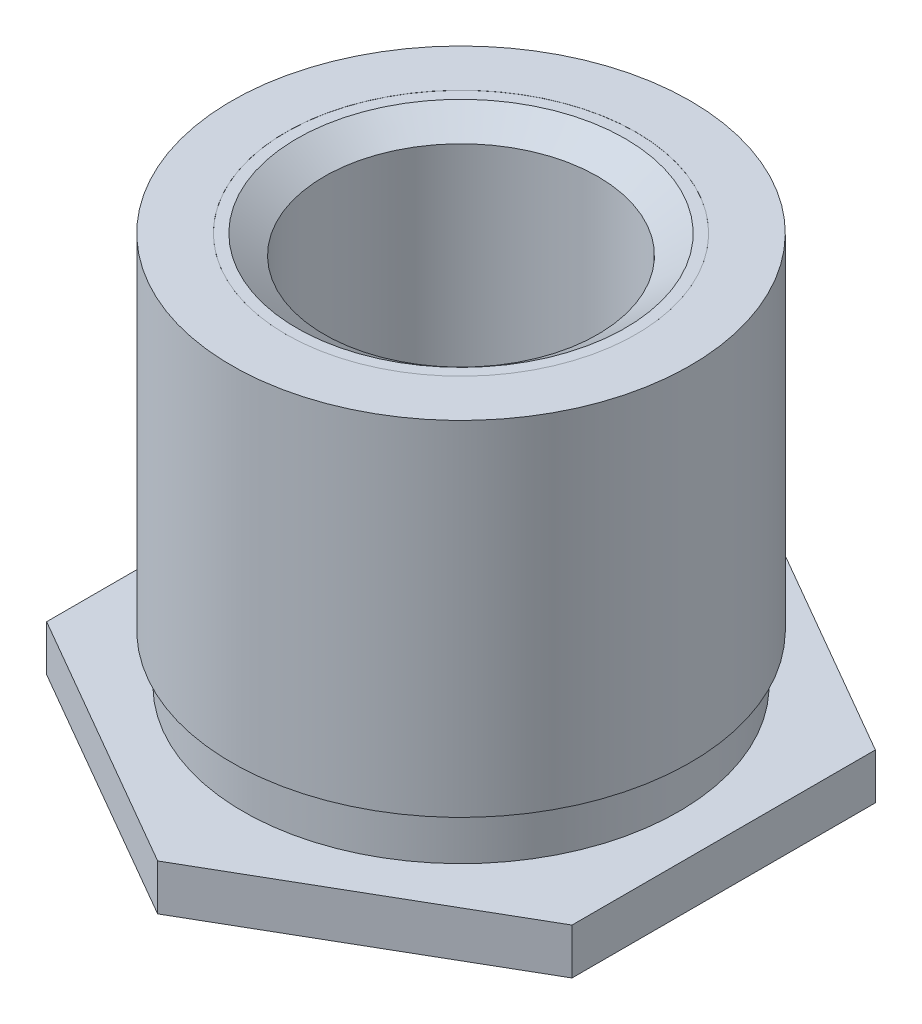
ISO-10303-21;
HEADER;
FILE_DESCRIPTION(('STEP AP214'),'2;1');
FILE_NAME('part.step','',(''),(''),'','','');
FILE_SCHEMA(('AUTOMOTIVE_DESIGN { 1 0 10303 214 1 1 1 1 }'));
ENDSEC;
DATA;
#1=APPLICATION_CONTEXT('core data for automotive mechanical design processes');
#2=APPLICATION_PROTOCOL_DEFINITION('international standard','automotive_design',2000,#1);
#3=PRODUCT_CONTEXT('',#1,'mechanical');
#4=PRODUCT('Part','Part','',(#3));
#5=PRODUCT_RELATED_PRODUCT_CATEGORY('part','',(#4));
#6=PRODUCT_DEFINITION_FORMATION('','',#4);
#7=PRODUCT_DEFINITION_CONTEXT('part definition',#1,'design');
#8=PRODUCT_DEFINITION('design','',#6,#7);
#9=PRODUCT_DEFINITION_SHAPE('','',#8);
#10=(LENGTH_UNIT() NAMED_UNIT(*) SI_UNIT(.MILLI.,.METRE.));
#11=(NAMED_UNIT(*) PLANE_ANGLE_UNIT() SI_UNIT($,.RADIAN.));
#12=(NAMED_UNIT(*) SI_UNIT($,.STERADIAN.) SOLID_ANGLE_UNIT());
#13=UNCERTAINTY_MEASURE_WITH_UNIT(LENGTH_MEASURE(1.E-05),#10,'distance_accuracy_value','');
#14=(GEOMETRIC_REPRESENTATION_CONTEXT(3) GLOBAL_UNCERTAINTY_ASSIGNED_CONTEXT((#13)) GLOBAL_UNIT_ASSIGNED_CONTEXT((#10,
#11,#12)) REPRESENTATION_CONTEXT('',''));
#15=CARTESIAN_POINT('',(0.,0.,0.));
#16=DIRECTION('',(0.,0.,1.));
#17=DIRECTION('',(1.,0.,0.));
#18=AXIS2_PLACEMENT_3D('',#15,#16,#17);
#19=CARTESIAN_POINT('',(2.784,0.419,0.));
#20=DIRECTION('',(0.,1.,0.));
#21=DIRECTION('',(0.,0.,1.));
#22=AXIS2_PLACEMENT_3D('',#19,#20,#21);
#23=PLANE('',#22);
#24=CARTESIAN_POINT('',(0.,0.419,0.));
#25=DIRECTION('',(0.,-1.,0.));
#26=DIRECTION('',(0.,0.,-1.));
#27=AXIS2_PLACEMENT_3D('',#24,#25,#26);
#28=CIRCLE('',#27,1.99025);
#29=CARTESIAN_POINT('',(0.,0.419,-1.99025));
#30=VERTEX_POINT('',#29);
#31=EDGE_CURVE('E11',#30,#30,#28,.T.);
#32=ORIENTED_EDGE('',*,*,#31,.T.);
#33=EDGE_LOOP('',(#32));
#34=FACE_BOUND('',#33,.T.);
#35=DIRECTION('',(0.866025403784439,0.,0.5));
#36=VECTOR('',#35,1.);
#37=CARTESIAN_POINT('',(0.,0.419,2.7712812921102));
#38=LINE('',#37,#36);
#39=CARTESIAN_POINT('',(-2.4,0.419,1.3856406460551));
#40=VERTEX_POINT('',#39);
#41=CARTESIAN_POINT('',(0.,0.419,2.7712812921102));
#42=VERTEX_POINT('',#41);
#43=EDGE_CURVE('E130',#40,#42,#38,.T.);
#44=ORIENTED_EDGE('',*,*,#43,.T.);
#45=DIRECTION('',(0.866025403784439,0.,-0.5));
#46=VECTOR('',#45,1.);
#47=CARTESIAN_POINT('',(2.4,0.419,1.3856406460551));
#48=LINE('',#47,#46);
#49=CARTESIAN_POINT('',(2.4,0.419,1.3856406460551));
#50=VERTEX_POINT('',#49);
#51=EDGE_CURVE('E119',#42,#50,#48,.T.);
#52=ORIENTED_EDGE('',*,*,#51,.T.);
#53=DIRECTION('',(0.,0.,-1.));
#54=VECTOR('',#53,1.);
#55=CARTESIAN_POINT('',(2.4,0.419,-1.3856406460551));
#56=LINE('',#55,#54);
#57=CARTESIAN_POINT('',(2.4,0.419,-1.3856406460551));
#58=VERTEX_POINT('',#57);
#59=EDGE_CURVE('E122',#50,#58,#56,.T.);
#60=ORIENTED_EDGE('',*,*,#59,.T.);
#61=DIRECTION('',(-0.866025403784439,0.,-0.5));
#62=VECTOR('',#61,1.);
#63=CARTESIAN_POINT('',(0.,0.419,-2.7712812921102));
#64=LINE('',#63,#62);
#65=CARTESIAN_POINT('',(0.,0.419,-2.7712812921102));
#66=VERTEX_POINT('',#65);
#67=EDGE_CURVE('E50',#58,#66,#64,.T.);
#68=ORIENTED_EDGE('',*,*,#67,.T.);
#69=DIRECTION('',(-0.866025403784439,0.,0.5));
#70=VECTOR('',#69,1.);
#71=CARTESIAN_POINT('',(-2.4,0.419,-1.3856406460551));
#72=LINE('',#71,#70);
#73=CARTESIAN_POINT('',(-2.4,0.419,-1.3856406460551));
#74=VERTEX_POINT('',#73);
#75=EDGE_CURVE('E95',#66,#74,#72,.T.);
#76=ORIENTED_EDGE('',*,*,#75,.T.);
#77=DIRECTION('',(0.,0.,1.));
#78=VECTOR('',#77,1.);
#79=CARTESIAN_POINT('',(-2.4,0.419,1.3856406460551));
#80=LINE('',#79,#78);
#81=EDGE_CURVE('E127',#74,#40,#80,.T.);
#82=ORIENTED_EDGE('',*,*,#81,.T.);
#83=EDGE_LOOP('',(#44,#52,#60,#68,#76,#82));
#84=FACE_BOUND('',#83,.T.);
#85=ADVANCED_FACE('F34',(#34,#84),#23,.T.);
#86=CARTESIAN_POINT('',(2.095,0.,0.));
#87=DIRECTION('',(0.,-1.,0.));
#88=DIRECTION('',(0.,0.,-1.));
#89=AXIS2_PLACEMENT_3D('',#86,#87,#88);
#90=PLANE('',#89);
#91=CARTESIAN_POINT('',(0.,0.,0.));
#92=DIRECTION('',(0.,-1.,0.));
#93=DIRECTION('',(0.,0.,-1.));
#94=AXIS2_PLACEMENT_3D('',#91,#92,#93);
#95=CIRCLE('',#94,2.095);
#96=CARTESIAN_POINT('',(0.,0.,-2.095));
#97=VERTEX_POINT('',#96);
#98=EDGE_CURVE('E149',#97,#97,#95,.T.);
#99=ORIENTED_EDGE('',*,*,#98,.F.);
#100=EDGE_LOOP('',(#99));
#101=FACE_BOUND('',#100,.T.);
#102=DIRECTION('',(0.,0.,-1.));
#103=VECTOR('',#102,1.);
#104=CARTESIAN_POINT('',(2.4,0.,-1.3856406460551));
#105=LINE('',#104,#103);
#106=CARTESIAN_POINT('',(2.4,0.,1.3856406460551));
#107=VERTEX_POINT('',#106);
#108=CARTESIAN_POINT('',(2.4,0.,-1.3856406460551));
#109=VERTEX_POINT('',#108);
#110=EDGE_CURVE('E105',#107,#109,#105,.T.);
#111=ORIENTED_EDGE('',*,*,#110,.F.);
#112=DIRECTION('',(0.866025403784439,0.,-0.5));
#113=VECTOR('',#112,1.);
#114=CARTESIAN_POINT('',(2.4,0.,1.3856406460551));
#115=LINE('',#114,#113);
#116=CARTESIAN_POINT('',(0.,0.,2.7712812921102));
#117=VERTEX_POINT('',#116);
#118=EDGE_CURVE('E58',#117,#107,#115,.T.);
#119=ORIENTED_EDGE('',*,*,#118,.F.);
#120=DIRECTION('',(0.866025403784439,0.,0.5));
#121=VECTOR('',#120,1.);
#122=CARTESIAN_POINT('',(0.,0.,2.7712812921102));
#123=LINE('',#122,#121);
#124=CARTESIAN_POINT('',(-2.4,0.,1.3856406460551));
#125=VERTEX_POINT('',#124);
#126=EDGE_CURVE('E112',#125,#117,#123,.T.);
#127=ORIENTED_EDGE('',*,*,#126,.F.);
#128=DIRECTION('',(0.,0.,1.));
#129=VECTOR('',#128,1.);
#130=CARTESIAN_POINT('',(-2.4,0.,1.3856406460551));
#131=LINE('',#130,#129);
#132=CARTESIAN_POINT('',(-2.4,0.,-1.3856406460551));
#133=VERTEX_POINT('',#132);
#134=EDGE_CURVE('E110',#133,#125,#131,.T.);
#135=ORIENTED_EDGE('',*,*,#134,.F.);
#136=DIRECTION('',(-0.866025403784439,0.,0.5));
#137=VECTOR('',#136,1.);
#138=CARTESIAN_POINT('',(-2.4,0.,-1.3856406460551));
#139=LINE('',#138,#137);
#140=CARTESIAN_POINT('',(0.,0.,-2.7712812921102));
#141=VERTEX_POINT('',#140);
#142=EDGE_CURVE('E92',#141,#133,#139,.T.);
#143=ORIENTED_EDGE('',*,*,#142,.F.);
#144=DIRECTION('',(-0.866025403784439,0.,-0.5));
#145=VECTOR('',#144,1.);
#146=CARTESIAN_POINT('',(0.,0.,-2.7712812921102));
#147=LINE('',#146,#145);
#148=EDGE_CURVE('E100',#109,#141,#147,.T.);
#149=ORIENTED_EDGE('',*,*,#148,.F.);
#150=EDGE_LOOP('',(#111,#119,#127,#135,#143,#149));
#151=FACE_BOUND('',#150,.T.);
#152=ADVANCED_FACE('F107',(#101,#151),#90,.T.);
#153=CARTESIAN_POINT('',(0.,0.,0.));
#154=DIRECTION('',(0.,-1.,0.));
#155=DIRECTION('',(0.,0.,-1.));
#156=AXIS2_PLACEMENT_3D('',#153,#154,#155);
#157=CYLINDRICAL_SURFACE('',#156,1.99025);
#158=CARTESIAN_POINT('',(0.,0.85895,0.));
#159=DIRECTION('',(0.,-1.,0.));
#160=DIRECTION('',(0.,0.,-1.));
#161=AXIS2_PLACEMENT_3D('',#158,#159,#160);
#162=CIRCLE('',#161,1.99025);
#163=CARTESIAN_POINT('',(0.,0.85895,-1.99025));
#164=VERTEX_POINT('',#163);
#165=EDGE_CURVE('E42',#164,#164,#162,.T.);
#166=ORIENTED_EDGE('',*,*,#165,.T.);
#167=EDGE_LOOP('',(#166));
#168=FACE_BOUND('',#167,.T.);
#169=ORIENTED_EDGE('',*,*,#31,.F.);
#170=EDGE_LOOP('',(#169));
#171=FACE_BOUND('',#170,.T.);
#172=ADVANCED_FACE('F188',(#168,#171),#157,.T.);
#173=CARTESIAN_POINT('',(2.095,0.85895,0.));
#174=DIRECTION('',(0.,-1.,0.));
#175=DIRECTION('',(0.,0.,-1.));
#176=AXIS2_PLACEMENT_3D('',#173,#174,#175);
#177=PLANE('',#176);
#178=CARTESIAN_POINT('',(0.,0.85895,0.));
#179=DIRECTION('',(0.,-1.,0.));
#180=DIRECTION('',(0.,0.,-1.));
#181=AXIS2_PLACEMENT_3D('',#178,#179,#180);
#182=CIRCLE('',#181,2.095);
#183=CARTESIAN_POINT('',(0.,0.85895,-2.095));
#184=VERTEX_POINT('',#183);
#185=EDGE_CURVE('E159',#184,#184,#182,.T.);
#186=ORIENTED_EDGE('',*,*,#185,.T.);
#187=EDGE_LOOP('',(#186));
#188=FACE_BOUND('',#187,.T.);
#189=ORIENTED_EDGE('',*,*,#165,.F.);
#190=EDGE_LOOP('',(#189));
#191=FACE_BOUND('',#190,.T.);
#192=ADVANCED_FACE('F182',(#188,#191),#177,.T.);
#193=CARTESIAN_POINT('',(0.,0.,0.));
#194=DIRECTION('',(0.,-1.,0.));
#195=DIRECTION('',(0.,0.,-1.));
#196=AXIS2_PLACEMENT_3D('',#193,#194,#195);
#197=CYLINDRICAL_SURFACE('',#196,2.095);
#198=CARTESIAN_POINT('',(0.,4.,0.));
#199=DIRECTION('',(0.,-1.,0.));
#200=DIRECTION('',(0.,0.,-1.));
#201=AXIS2_PLACEMENT_3D('',#198,#199,#200);
#202=CIRCLE('',#201,2.095);
#203=CARTESIAN_POINT('',(0.,4.,-2.095));
#204=VERTEX_POINT('',#203);
#205=EDGE_CURVE('E156',#204,#204,#202,.T.);
#206=ORIENTED_EDGE('',*,*,#205,.T.);
#207=EDGE_LOOP('',(#206));
#208=FACE_BOUND('',#207,.T.);
#209=ORIENTED_EDGE('',*,*,#185,.F.);
#210=EDGE_LOOP('',(#209));
#211=FACE_BOUND('',#210,.T.);
#212=ADVANCED_FACE('F176',(#208,#211),#197,.T.);
#213=CARTESIAN_POINT('',(2.095,4.,0.));
#214=DIRECTION('',(0.,1.,0.));
#215=DIRECTION('',(0.,0.,1.));
#216=AXIS2_PLACEMENT_3D('',#213,#214,#215);
#217=PLANE('',#216);
#218=CARTESIAN_POINT('',(0.,4.,0.));
#219=DIRECTION('',(0.,1.,0.));
#220=DIRECTION('',(0.,0.,1.));
#221=AXIS2_PLACEMENT_3D('',#218,#219,#220);
#222=CIRCLE('',#221,1.6);
#223=CARTESIAN_POINT('',(0.,4.,1.6));
#224=VERTEX_POINT('',#223);
#225=EDGE_CURVE('E37',#224,#224,#222,.T.);
#226=ORIENTED_EDGE('',*,*,#225,.F.);
#227=EDGE_LOOP('',(#226));
#228=FACE_BOUND('',#227,.T.);
#229=ORIENTED_EDGE('',*,*,#205,.F.);
#230=EDGE_LOOP('',(#229));
#231=FACE_BOUND('',#230,.T.);
#232=ADVANCED_FACE('F172',(#228,#231),#217,.T.);
#233=CARTESIAN_POINT('',(0.,0.,0.));
#234=DIRECTION('',(0.,-1.,0.));
#235=DIRECTION('',(0.,0.,-1.));
#236=AXIS2_PLACEMENT_3D('',#233,#234,#235);
#237=CYLINDRICAL_SURFACE('',#236,1.25);
#238=CARTESIAN_POINT('',(0.,3.8240131336967,0.));
#239=DIRECTION('',(0.,-1.,0.));
#240=DIRECTION('',(0.,0.,-1.));
#241=AXIS2_PLACEMENT_3D('',#238,#239,#240);
#242=CIRCLE('',#241,1.25);
#243=CARTESIAN_POINT('',(0.,3.8240131336967,-1.25));
#244=VERTEX_POINT('',#243);
#245=EDGE_CURVE('E143',#244,#244,#242,.T.);
#246=ORIENTED_EDGE('',*,*,#245,.F.);
#247=EDGE_LOOP('',(#246));
#248=FACE_BOUND('',#247,.T.);
#249=CARTESIAN_POINT('',(0.,0.00253999999999969,0.));
#250=DIRECTION('',(0.,-1.,0.));
#251=DIRECTION('',(0.,0.,-1.));
#252=AXIS2_PLACEMENT_3D('',#249,#250,#251);
#253=CIRCLE('',#252,1.25);
#254=CARTESIAN_POINT('',(0.,0.00253999999999969,-1.25));
#255=VERTEX_POINT('',#254);
#256=EDGE_CURVE('E153',#255,#255,#253,.T.);
#257=ORIENTED_EDGE('',*,*,#256,.T.);
#258=EDGE_LOOP('',(#257));
#259=FACE_BOUND('',#258,.T.);
#260=ADVANCED_FACE('F175',(#248,#259),#237,.F.);
#261=CARTESIAN_POINT('',(2.095,0.00253999999999969,0.));
#262=DIRECTION('',(0.,-1.,0.));
#263=DIRECTION('',(0.,0.,-1.));
#264=AXIS2_PLACEMENT_3D('',#261,#262,#263);
#265=PLANE('',#264);
#266=ORIENTED_EDGE('',*,*,#256,.F.);
#267=EDGE_LOOP('',(#266));
#268=FACE_BOUND('',#267,.T.);
#269=CARTESIAN_POINT('',(0.,0.00253999999999982,0.));
#270=DIRECTION('',(0.,-1.,0.));
#271=DIRECTION('',(0.,0.,-1.));
#272=AXIS2_PLACEMENT_3D('',#269,#270,#271);
#273=CIRCLE('',#272,2.095);
#274=CARTESIAN_POINT('',(0.,0.00253999999999982,-2.095));
#275=VERTEX_POINT('',#274);
#276=EDGE_CURVE('E152',#275,#275,#273,.T.);
#277=ORIENTED_EDGE('',*,*,#276,.T.);
#278=EDGE_LOOP('',(#277));
#279=FACE_BOUND('',#278,.T.);
#280=ADVANCED_FACE('F234',(#268,#279),#265,.T.);
#281=CARTESIAN_POINT('',(0.,0.,0.));
#282=DIRECTION('',(0.,-1.,0.));
#283=DIRECTION('',(0.,0.,-1.));
#284=AXIS2_PLACEMENT_3D('',#281,#282,#283);
#285=CYLINDRICAL_SURFACE('',#284,2.095);
#286=ORIENTED_EDGE('',*,*,#98,.T.);
#287=EDGE_LOOP('',(#286));
#288=FACE_BOUND('',#287,.T.);
#289=ORIENTED_EDGE('',*,*,#276,.F.);
#290=EDGE_LOOP('',(#289));
#291=FACE_BOUND('',#290,.T.);
#292=ADVANCED_FACE('F227',(#288,#291),#285,.F.);
#293=CARTESIAN_POINT('',(1.6,3.999,0.));
#294=DIRECTION('',(0.,-1.,0.));
#295=DIRECTION('',(0.,0.,-1.));
#296=AXIS2_PLACEMENT_3D('',#293,#294,#295);
#297=PLANE('',#296);
#298=CARTESIAN_POINT('',(0.,3.999,0.));
#299=DIRECTION('',(0.,-1.,0.));
#300=DIRECTION('',(0.,0.,-1.));
#301=AXIS2_PLACEMENT_3D('',#298,#299,#300);
#302=CIRCLE('',#301,1.6);
#303=CARTESIAN_POINT('',(0.,3.999,-1.6));
#304=VERTEX_POINT('',#303);
#305=EDGE_CURVE('E135',#304,#304,#302,.T.);
#306=ORIENTED_EDGE('',*,*,#305,.F.);
#307=EDGE_LOOP('',(#306));
#308=FACE_BOUND('',#307,.T.);
#309=CARTESIAN_POINT('',(0.,3.999,0.));
#310=DIRECTION('',(0.,-1.,0.));
#311=DIRECTION('',(0.,0.,-1.));
#312=AXIS2_PLACEMENT_3D('',#309,#310,#311);
#313=CIRCLE('',#312,1.5);
#314=CARTESIAN_POINT('',(0.,3.999,-1.5));
#315=VERTEX_POINT('',#314);
#316=EDGE_CURVE('E146',#315,#315,#313,.T.);
#317=ORIENTED_EDGE('',*,*,#316,.T.);
#318=EDGE_LOOP('',(#317));
#319=FACE_BOUND('',#318,.T.);
#320=ADVANCED_FACE('F223',(#308,#319),#297,.F.);
#321=CARTESIAN_POINT('',(0.,3.8240131336967,0.));
#322=DIRECTION('',(0.,1.,0.));
#323=DIRECTION('',(0.,0.,1.));
#324=AXIS2_PLACEMENT_3D('',#321,#322,#323);
#325=CONICAL_SURFACE('',#324,1.25,0.960105621522081);
#326=ORIENTED_EDGE('',*,*,#316,.F.);
#327=EDGE_LOOP('',(#326));
#328=FACE_BOUND('',#327,.T.);
#329=ORIENTED_EDGE('',*,*,#245,.T.);
#330=EDGE_LOOP('',(#329));
#331=FACE_BOUND('',#330,.T.);
#332=ADVANCED_FACE('F220',(#328,#331),#325,.F.);
#333=CARTESIAN_POINT('',(0.,-2.54,0.));
#334=DIRECTION('',(0.,-1.,0.));
#335=DIRECTION('',(0.,0.,-1.));
#336=AXIS2_PLACEMENT_3D('',#333,#334,#335);
#337=CYLINDRICAL_SURFACE('',#336,1.6);
#338=ORIENTED_EDGE('',*,*,#225,.T.);
#339=EDGE_LOOP('',(#338));
#340=FACE_BOUND('',#339,.T.);
#341=ORIENTED_EDGE('',*,*,#305,.T.);
#342=EDGE_LOOP('',(#341));
#343=FACE_BOUND('',#342,.T.);
#344=ADVANCED_FACE('F169',(#340,#343),#337,.F.);
#345=CARTESIAN_POINT('',(2.4,0.,1.3856406460551));
#346=DIRECTION('',(0.5,0.,0.866025403784439));
#347=DIRECTION('',(0.866025403784439,0.,-0.5));
#348=AXIS2_PLACEMENT_3D('',#345,#346,#347);
#349=PLANE('',#348);
#350=ORIENTED_EDGE('',*,*,#51,.F.);
#351=DIRECTION('',(0.,1.,0.));
#352=VECTOR('',#351,1.);
#353=CARTESIAN_POINT('',(0.,0.,2.7712812921102));
#354=LINE('',#353,#352);
#355=EDGE_CURVE('E133',#117,#42,#354,.T.);
#356=ORIENTED_EDGE('',*,*,#355,.F.);
#357=ORIENTED_EDGE('',*,*,#118,.T.);
#358=DIRECTION('',(0.,1.,0.));
#359=VECTOR('',#358,1.);
#360=CARTESIAN_POINT('',(2.4,0.,1.3856406460551));
#361=LINE('',#360,#359);
#362=EDGE_CURVE('E118',#107,#50,#361,.T.);
#363=ORIENTED_EDGE('',*,*,#362,.T.);
#364=EDGE_LOOP('',(#350,#356,#357,#363));
#365=FACE_BOUND('',#364,.T.);
#366=ADVANCED_FACE('F203',(#365),#349,.T.);
#367=CARTESIAN_POINT('',(0.,0.,2.7712812921102));
#368=DIRECTION('',(-0.5,0.,0.866025403784439));
#369=DIRECTION('',(0.866025403784439,0.,0.5));
#370=AXIS2_PLACEMENT_3D('',#367,#368,#369);
#371=PLANE('',#370);
#372=ORIENTED_EDGE('',*,*,#43,.F.);
#373=DIRECTION('',(0.,1.,0.));
#374=VECTOR('',#373,1.);
#375=CARTESIAN_POINT('',(-2.4,0.,1.3856406460551));
#376=LINE('',#375,#374);
#377=EDGE_CURVE('E136',#125,#40,#376,.T.);
#378=ORIENTED_EDGE('',*,*,#377,.F.);
#379=ORIENTED_EDGE('',*,*,#126,.T.);
#380=ORIENTED_EDGE('',*,*,#355,.T.);
#381=EDGE_LOOP('',(#372,#378,#379,#380));
#382=FACE_BOUND('',#381,.T.);
#383=ADVANCED_FACE('F202',(#382),#371,.T.);
#384=CARTESIAN_POINT('',(-2.4,0.,1.3856406460551));
#385=DIRECTION('',(-1.,0.,0.));
#386=DIRECTION('',(0.,0.,1.));
#387=AXIS2_PLACEMENT_3D('',#384,#385,#386);
#388=PLANE('',#387);
#389=ORIENTED_EDGE('',*,*,#81,.F.);
#390=DIRECTION('',(0.,1.,0.));
#391=VECTOR('',#390,1.);
#392=CARTESIAN_POINT('',(-2.4,0.,-1.3856406460551));
#393=LINE('',#392,#391);
#394=EDGE_CURVE('E96',#133,#74,#393,.T.);
#395=ORIENTED_EDGE('',*,*,#394,.F.);
#396=ORIENTED_EDGE('',*,*,#134,.T.);
#397=ORIENTED_EDGE('',*,*,#377,.T.);
#398=EDGE_LOOP('',(#389,#395,#396,#397));
#399=FACE_BOUND('',#398,.T.);
#400=ADVANCED_FACE('F280',(#399),#388,.T.);
#401=CARTESIAN_POINT('',(-2.4,0.,-1.3856406460551));
#402=DIRECTION('',(-0.5,0.,-0.866025403784438));
#403=DIRECTION('',(-0.866025403784439,0.,0.5));
#404=AXIS2_PLACEMENT_3D('',#401,#402,#403);
#405=PLANE('',#404);
#406=ORIENTED_EDGE('',*,*,#75,.F.);
#407=DIRECTION('',(0.,1.,0.));
#408=VECTOR('',#407,1.);
#409=CARTESIAN_POINT('',(0.,0.,-2.7712812921102));
#410=LINE('',#409,#408);
#411=EDGE_CURVE('E88',#141,#66,#410,.T.);
#412=ORIENTED_EDGE('',*,*,#411,.F.);
#413=ORIENTED_EDGE('',*,*,#142,.T.);
#414=ORIENTED_EDGE('',*,*,#394,.T.);
#415=EDGE_LOOP('',(#406,#412,#413,#414));
#416=FACE_BOUND('',#415,.T.);
#417=ADVANCED_FACE('F90',(#416),#405,.T.);
#418=CARTESIAN_POINT('',(0.,0.,-2.7712812921102));
#419=DIRECTION('',(0.5,0.,-0.866025403784439));
#420=DIRECTION('',(-0.866025403784439,0.,-0.5));
#421=AXIS2_PLACEMENT_3D('',#418,#419,#420);
#422=PLANE('',#421);
#423=ORIENTED_EDGE('',*,*,#67,.F.);
#424=DIRECTION('',(0.,1.,0.));
#425=VECTOR('',#424,1.);
#426=CARTESIAN_POINT('',(2.4,0.,-1.3856406460551));
#427=LINE('',#426,#425);
#428=EDGE_CURVE('E97',#109,#58,#427,.T.);
#429=ORIENTED_EDGE('',*,*,#428,.F.);
#430=ORIENTED_EDGE('',*,*,#148,.T.);
#431=ORIENTED_EDGE('',*,*,#411,.T.);
#432=EDGE_LOOP('',(#423,#429,#430,#431));
#433=FACE_BOUND('',#432,.T.);
#434=ADVANCED_FACE('F101',(#433),#422,.T.);
#435=CARTESIAN_POINT('',(2.4,0.,-1.3856406460551));
#436=DIRECTION('',(1.,0.,0.));
#437=DIRECTION('',(0.,0.,-1.));
#438=AXIS2_PLACEMENT_3D('',#435,#436,#437);
#439=PLANE('',#438);
#440=ORIENTED_EDGE('',*,*,#59,.F.);
#441=ORIENTED_EDGE('',*,*,#362,.F.);
#442=ORIENTED_EDGE('',*,*,#110,.T.);
#443=ORIENTED_EDGE('',*,*,#428,.T.);
#444=EDGE_LOOP('',(#440,#441,#442,#443));
#445=FACE_BOUND('',#444,.T.);
#446=ADVANCED_FACE('F206',(#445),#439,.T.);
#447=CLOSED_SHELL('',(#85,#152,#172,#192,#212,#232,#260,#280,#292,#320,#332,#344,#366,#383,#400,
#417,#434,#446));
#448=MANIFOLD_SOLID_BREP('B2',#447);
#449=ADVANCED_BREP_SHAPE_REPRESENTATION('',(#18,#448),#14);
#450=SHAPE_DEFINITION_REPRESENTATION(#9,#449);
ENDSEC;
END-ISO-10303-21;
